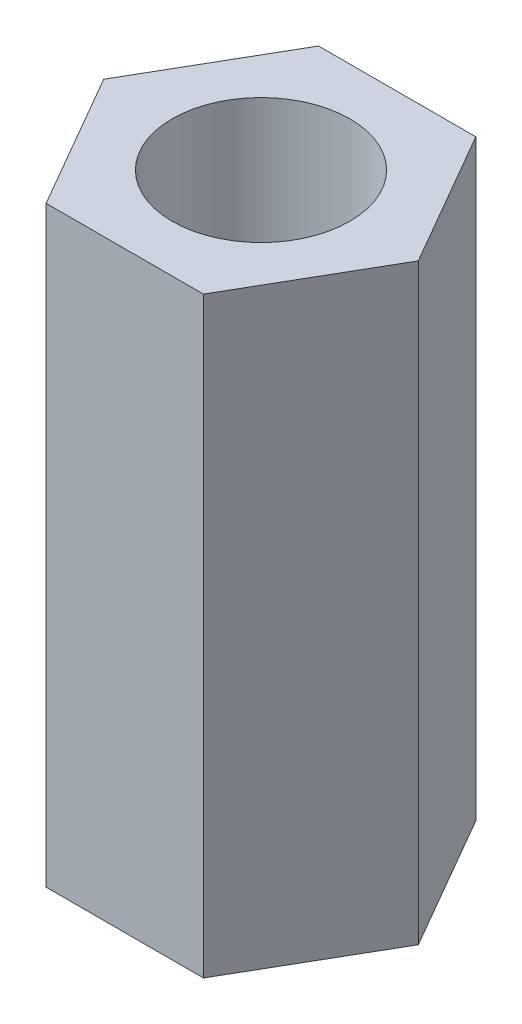
ISO-10303-21;
HEADER;
FILE_DESCRIPTION(('STEP AP214'),'2;1');
FILE_NAME('part.step','',(''),(''),'','','');
FILE_SCHEMA(('AUTOMOTIVE_DESIGN { 1 0 10303 214 1 1 1 1 }'));
ENDSEC;
DATA;
#1=APPLICATION_CONTEXT('core data for automotive mechanical design processes');
#2=APPLICATION_PROTOCOL_DEFINITION('international standard','automotive_design',2000,#1);
#3=PRODUCT_CONTEXT('',#1,'mechanical');
#4=PRODUCT('Part','Part','',(#3));
#5=PRODUCT_RELATED_PRODUCT_CATEGORY('part','',(#4));
#6=PRODUCT_DEFINITION_FORMATION('','',#4);
#7=PRODUCT_DEFINITION_CONTEXT('part definition',#1,'design');
#8=PRODUCT_DEFINITION('design','',#6,#7);
#9=PRODUCT_DEFINITION_SHAPE('','',#8);
#10=(LENGTH_UNIT() NAMED_UNIT(*) SI_UNIT(.MILLI.,.METRE.));
#11=(NAMED_UNIT(*) PLANE_ANGLE_UNIT() SI_UNIT($,.RADIAN.));
#12=(NAMED_UNIT(*) SI_UNIT($,.STERADIAN.) SOLID_ANGLE_UNIT());
#13=UNCERTAINTY_MEASURE_WITH_UNIT(LENGTH_MEASURE(1.E-05),#10,'distance_accuracy_value','');
#14=(GEOMETRIC_REPRESENTATION_CONTEXT(3) GLOBAL_UNCERTAINTY_ASSIGNED_CONTEXT((#13)) GLOBAL_UNIT_ASSIGNED_CONTEXT((#10,
#11,#12)) REPRESENTATION_CONTEXT('',''));
#15=CARTESIAN_POINT('',(0.,0.,0.));
#16=DIRECTION('',(0.,0.,1.));
#17=DIRECTION('',(1.,0.,0.));
#18=AXIS2_PLACEMENT_3D('',#15,#16,#17);
#19=CARTESIAN_POINT('',(-1.99185842870421,5.,1.15));
#20=DIRECTION('',(0.866025403784439,0.,-0.5));
#21=DIRECTION('',(-0.5,0.,-0.866025403784439));
#22=AXIS2_PLACEMENT_3D('',#19,#20,#21);
#23=PLANE('',#22);
#24=DIRECTION('',(0.5,0.,0.866025403784439));
#25=VECTOR('',#24,1.);
#26=CARTESIAN_POINT('',(-1.99185842870421,0.,1.15));
#27=LINE('',#26,#25);
#28=CARTESIAN_POINT('',(-2.65581123827228,0.,0.));
#29=VERTEX_POINT('',#28);
#30=CARTESIAN_POINT('',(-1.32790561913614,0.,2.3));
#31=VERTEX_POINT('',#30);
#32=EDGE_CURVE('E129',#29,#31,#27,.T.);
#33=ORIENTED_EDGE('',*,*,#32,.T.);
#34=DIRECTION('',(0.,-1.,0.));
#35=VECTOR('',#34,1.);
#36=CARTESIAN_POINT('',(-1.32790561913614,5.,2.3));
#37=LINE('',#36,#35);
#38=CARTESIAN_POINT('',(-1.32790561913612,10.,2.30000000000001));
#39=VERTEX_POINT('',#38);
#40=EDGE_CURVE('E11',#39,#31,#37,.T.);
#41=ORIENTED_EDGE('',*,*,#40,.F.);
#42=DIRECTION('',(0.500000000000005,0.,0.866025403784436));
#43=VECTOR('',#42,1.);
#44=CARTESIAN_POINT('',(-2.65581123827228,10.,0.));
#45=LINE('',#44,#43);
#46=CARTESIAN_POINT('',(-2.65581123827228,10.,0.));
#47=VERTEX_POINT('',#46);
#48=EDGE_CURVE('E120',#47,#39,#45,.T.);
#49=ORIENTED_EDGE('',*,*,#48,.F.);
#50=DIRECTION('',(0.,-1.,0.));
#51=VECTOR('',#50,1.);
#52=CARTESIAN_POINT('',(-2.65581123827228,5.,0.));
#53=LINE('',#52,#51);
#54=EDGE_CURVE('E139',#47,#29,#53,.T.);
#55=ORIENTED_EDGE('',*,*,#54,.T.);
#56=EDGE_LOOP('',(#33,#41,#49,#55));
#57=FACE_BOUND('',#56,.T.);
#58=ADVANCED_FACE('F36',(#57),#23,.F.);
#59=CARTESIAN_POINT('',(0.,5.,2.3));
#60=DIRECTION('',(0.,0.,-1.));
#61=DIRECTION('',(-1.,0.,0.));
#62=AXIS2_PLACEMENT_3D('',#59,#60,#61);
#63=PLANE('',#62);
#64=DIRECTION('',(1.,0.,0.));
#65=VECTOR('',#64,1.);
#66=CARTESIAN_POINT('',(0.,0.,2.3));
#67=LINE('',#66,#65);
#68=CARTESIAN_POINT('',(1.32790561913614,0.,2.3));
#69=VERTEX_POINT('',#68);
#70=EDGE_CURVE('E132',#31,#69,#67,.T.);
#71=ORIENTED_EDGE('',*,*,#70,.T.);
#72=DIRECTION('',(0.,-1.,0.));
#73=VECTOR('',#72,1.);
#74=CARTESIAN_POINT('',(1.32790561913614,5.,2.3));
#75=LINE('',#74,#73);
#76=CARTESIAN_POINT('',(1.32790561913616,10.,2.29999999999999));
#77=VERTEX_POINT('',#76);
#78=EDGE_CURVE('E44',#77,#69,#75,.T.);
#79=ORIENTED_EDGE('',*,*,#78,.F.);
#80=DIRECTION('',(1.,0.,0.));
#81=VECTOR('',#80,1.);
#82=CARTESIAN_POINT('',(-1.32790561913612,10.,2.30000000000001));
#83=LINE('',#82,#81);
#84=EDGE_CURVE('E123',#39,#77,#83,.T.);
#85=ORIENTED_EDGE('',*,*,#84,.F.);
#86=ORIENTED_EDGE('',*,*,#40,.T.);
#87=EDGE_LOOP('',(#71,#79,#85,#86));
#88=FACE_BOUND('',#87,.T.);
#89=ADVANCED_FACE('F154',(#88),#63,.F.);
#90=CARTESIAN_POINT('',(1.99185842870421,5.,1.15));
#91=DIRECTION('',(-0.866025403784438,0.,-0.5));
#92=DIRECTION('',(-0.5,0.,0.866025403784438));
#93=AXIS2_PLACEMENT_3D('',#90,#91,#92);
#94=PLANE('',#93);
#95=DIRECTION('',(0.5,0.,-0.866025403784439));
#96=VECTOR('',#95,1.);
#97=CARTESIAN_POINT('',(1.99185842870421,0.,1.15));
#98=LINE('',#97,#96);
#99=CARTESIAN_POINT('',(2.65581123827228,0.,0.));
#100=VERTEX_POINT('',#99);
#101=EDGE_CURVE('E134',#69,#100,#98,.T.);
#102=ORIENTED_EDGE('',*,*,#101,.T.);
#103=DIRECTION('',(0.,-1.,0.));
#104=VECTOR('',#103,1.);
#105=CARTESIAN_POINT('',(2.65581123827228,5.,0.));
#106=LINE('',#105,#104);
#107=CARTESIAN_POINT('',(2.65581123827228,10.,0.));
#108=VERTEX_POINT('',#107);
#109=EDGE_CURVE('E97',#108,#100,#106,.T.);
#110=ORIENTED_EDGE('',*,*,#109,.F.);
#111=DIRECTION('',(0.499999999999991,0.,-0.866025403784444));
#112=VECTOR('',#111,1.);
#113=CARTESIAN_POINT('',(1.32790561913616,10.,2.29999999999999));
#114=LINE('',#113,#112);
#115=EDGE_CURVE('E113',#77,#108,#114,.T.);
#116=ORIENTED_EDGE('',*,*,#115,.F.);
#117=ORIENTED_EDGE('',*,*,#78,.T.);
#118=EDGE_LOOP('',(#102,#110,#116,#117));
#119=FACE_BOUND('',#118,.T.);
#120=ADVANCED_FACE('F145',(#119),#94,.F.);
#121=CARTESIAN_POINT('',(1.99185842870421,5.,-1.15));
#122=DIRECTION('',(-0.866025403784439,0.,0.5));
#123=DIRECTION('',(0.5,0.,0.866025403784439));
#124=AXIS2_PLACEMENT_3D('',#121,#122,#123);
#125=PLANE('',#124);
#126=DIRECTION('',(-0.5,0.,-0.866025403784439));
#127=VECTOR('',#126,1.);
#128=CARTESIAN_POINT('',(1.99185842870421,0.,-1.15));
#129=LINE('',#128,#127);
#130=CARTESIAN_POINT('',(1.32790561913614,0.,-2.3));
#131=VERTEX_POINT('',#130);
#132=EDGE_CURVE('E96',#100,#131,#129,.T.);
#133=ORIENTED_EDGE('',*,*,#132,.T.);
#134=DIRECTION('',(0.,-1.,0.));
#135=VECTOR('',#134,1.);
#136=CARTESIAN_POINT('',(1.32790561913614,5.,-2.3));
#137=LINE('',#136,#135);
#138=CARTESIAN_POINT('',(1.32790561913614,10.,-2.3));
#139=VERTEX_POINT('',#138);
#140=EDGE_CURVE('E89',#139,#131,#137,.T.);
#141=ORIENTED_EDGE('',*,*,#140,.F.);
#142=DIRECTION('',(-0.500000000000005,0.,-0.866025403784436));
#143=VECTOR('',#142,1.);
#144=CARTESIAN_POINT('',(2.65581123827228,10.,0.));
#145=LINE('',#144,#143);
#146=EDGE_CURVE('E94',#108,#139,#145,.T.);
#147=ORIENTED_EDGE('',*,*,#146,.F.);
#148=ORIENTED_EDGE('',*,*,#109,.T.);
#149=EDGE_LOOP('',(#133,#141,#147,#148));
#150=FACE_BOUND('',#149,.T.);
#151=ADVANCED_FACE('F91',(#150),#125,.F.);
#152=CARTESIAN_POINT('',(0.,5.,-2.3));
#153=DIRECTION('',(0.,0.,1.));
#154=DIRECTION('',(1.,0.,0.));
#155=AXIS2_PLACEMENT_3D('',#152,#153,#154);
#156=PLANE('',#155);
#157=DIRECTION('',(-1.,0.,0.));
#158=VECTOR('',#157,1.);
#159=CARTESIAN_POINT('',(0.,0.,-2.3));
#160=LINE('',#159,#158);
#161=CARTESIAN_POINT('',(-1.32790561913614,0.,-2.3));
#162=VERTEX_POINT('',#161);
#163=EDGE_CURVE('E59',#131,#162,#160,.T.);
#164=ORIENTED_EDGE('',*,*,#163,.T.);
#165=DIRECTION('',(0.,-1.,0.));
#166=VECTOR('',#165,1.);
#167=CARTESIAN_POINT('',(-1.32790561913614,5.,-2.3));
#168=LINE('',#167,#166);
#169=CARTESIAN_POINT('',(-1.32790561913614,10.,-2.3));
#170=VERTEX_POINT('',#169);
#171=EDGE_CURVE('E98',#170,#162,#168,.T.);
#172=ORIENTED_EDGE('',*,*,#171,.F.);
#173=DIRECTION('',(-1.,0.,0.));
#174=VECTOR('',#173,1.);
#175=CARTESIAN_POINT('',(1.32790561913614,10.,-2.3));
#176=LINE('',#175,#174);
#177=EDGE_CURVE('E101',#139,#170,#176,.T.);
#178=ORIENTED_EDGE('',*,*,#177,.F.);
#179=ORIENTED_EDGE('',*,*,#140,.T.);
#180=EDGE_LOOP('',(#164,#172,#178,#179));
#181=FACE_BOUND('',#180,.T.);
#182=ADVANCED_FACE('F102',(#181),#156,.F.);
#183=CARTESIAN_POINT('',(0.,5.,0.));
#184=DIRECTION('',(0.,-1.,0.));
#185=DIRECTION('',(0.,0.,-1.));
#186=AXIS2_PLACEMENT_3D('',#183,#184,#185);
#187=CYLINDRICAL_SURFACE('',#186,1.5);
#188=CARTESIAN_POINT('',(0.,0.,0.));
#189=DIRECTION('',(0.,1.,0.));
#190=DIRECTION('',(0.,0.,1.));
#191=AXIS2_PLACEMENT_3D('',#188,#189,#190);
#192=CIRCLE('',#191,1.5);
#193=CARTESIAN_POINT('',(0.,0.,1.5));
#194=VERTEX_POINT('',#193);
#195=EDGE_CURVE('E126',#194,#194,#192,.T.);
#196=ORIENTED_EDGE('',*,*,#195,.F.);
#197=EDGE_LOOP('',(#196));
#198=FACE_BOUND('',#197,.T.);
#199=CARTESIAN_POINT('',(0.,10.,0.));
#200=DIRECTION('',(0.,1.,0.));
#201=DIRECTION('',(0.,0.,1.));
#202=AXIS2_PLACEMENT_3D('',#199,#200,#201);
#203=CIRCLE('',#202,1.5);
#204=CARTESIAN_POINT('',(0.,10.,1.5));
#205=VERTEX_POINT('',#204);
#206=EDGE_CURVE('E114',#205,#205,#203,.T.);
#207=ORIENTED_EDGE('',*,*,#206,.T.);
#208=EDGE_LOOP('',(#207));
#209=FACE_BOUND('',#208,.T.);
#210=ADVANCED_FACE('F38',(#198,#209),#187,.F.);
#211=CARTESIAN_POINT('',(-1.99185842870421,5.,-1.15));
#212=DIRECTION('',(0.866025403784439,0.,0.5));
#213=DIRECTION('',(0.5,0.,-0.866025403784439));
#214=AXIS2_PLACEMENT_3D('',#211,#212,#213);
#215=PLANE('',#214);
#216=DIRECTION('',(-0.5,0.,0.866025403784439));
#217=VECTOR('',#216,1.);
#218=CARTESIAN_POINT('',(-1.99185842870421,0.,-1.15));
#219=LINE('',#218,#217);
#220=EDGE_CURVE('E51',#162,#29,#219,.T.);
#221=ORIENTED_EDGE('',*,*,#220,.T.);
#222=ORIENTED_EDGE('',*,*,#54,.F.);
#223=DIRECTION('',(-0.499999999999997,0.,0.86602540378444));
#224=VECTOR('',#223,1.);
#225=CARTESIAN_POINT('',(-1.32790561913614,10.,-2.3));
#226=LINE('',#225,#224);
#227=EDGE_CURVE('E106',#170,#47,#226,.T.);
#228=ORIENTED_EDGE('',*,*,#227,.F.);
#229=ORIENTED_EDGE('',*,*,#171,.T.);
#230=EDGE_LOOP('',(#221,#222,#228,#229));
#231=FACE_BOUND('',#230,.T.);
#232=ADVANCED_FACE('F153',(#231),#215,.F.);
#233=CARTESIAN_POINT('',(0.,0.,0.));
#234=DIRECTION('',(0.,1.,0.));
#235=DIRECTION('',(0.,0.,1.));
#236=AXIS2_PLACEMENT_3D('',#233,#234,#235);
#237=PLANE('',#236);
#238=ORIENTED_EDGE('',*,*,#195,.T.);
#239=EDGE_LOOP('',(#238));
#240=FACE_BOUND('',#239,.T.);
#241=ORIENTED_EDGE('',*,*,#32,.F.);
#242=ORIENTED_EDGE('',*,*,#220,.F.);
#243=ORIENTED_EDGE('',*,*,#163,.F.);
#244=ORIENTED_EDGE('',*,*,#132,.F.);
#245=ORIENTED_EDGE('',*,*,#101,.F.);
#246=ORIENTED_EDGE('',*,*,#70,.F.);
#247=EDGE_LOOP('',(#241,#242,#243,#244,#245,#246));
#248=FACE_BOUND('',#247,.T.);
#249=ADVANCED_FACE('F150',(#240,#248),#237,.F.);
#250=CARTESIAN_POINT('',(0.,10.,0.));
#251=DIRECTION('',(0.,1.,0.));
#252=DIRECTION('',(0.,0.,1.));
#253=AXIS2_PLACEMENT_3D('',#250,#251,#252);
#254=PLANE('',#253);
#255=ORIENTED_EDGE('',*,*,#146,.T.);
#256=ORIENTED_EDGE('',*,*,#177,.T.);
#257=ORIENTED_EDGE('',*,*,#227,.T.);
#258=ORIENTED_EDGE('',*,*,#48,.T.);
#259=ORIENTED_EDGE('',*,*,#84,.T.);
#260=ORIENTED_EDGE('',*,*,#115,.T.);
#261=EDGE_LOOP('',(#255,#256,#257,#258,#259,#260));
#262=FACE_BOUND('',#261,.T.);
#263=ORIENTED_EDGE('',*,*,#206,.F.);
#264=EDGE_LOOP('',(#263));
#265=FACE_BOUND('',#264,.T.);
#266=ADVANCED_FACE('F109',(#262,#265),#254,.T.);
#267=CLOSED_SHELL('',(#58,#89,#120,#151,#182,#210,#232,#249,#266));
#268=MANIFOLD_SOLID_BREP('B2',#267);
#269=ADVANCED_BREP_SHAPE_REPRESENTATION('',(#18,#268),#14);
#270=SHAPE_DEFINITION_REPRESENTATION(#9,#269);
ENDSEC;
END-ISO-10303-21;
